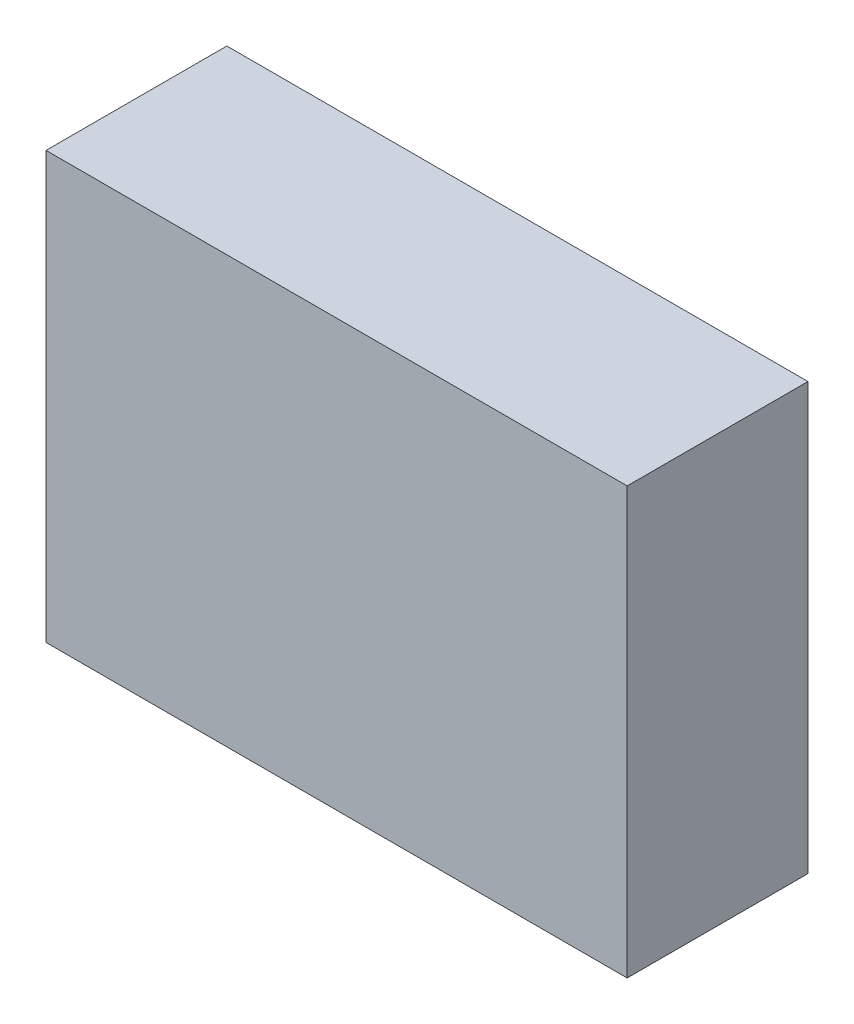
ISO-10303-21;
HEADER;
FILE_DESCRIPTION(('STEP AP214'),'2;1');
FILE_NAME('part.step','',(''),(''),'','','');
FILE_SCHEMA(('AUTOMOTIVE_DESIGN { 1 0 10303 214 1 1 1 1 }'));
ENDSEC;
DATA;
#1=APPLICATION_CONTEXT('core data for automotive mechanical design processes');
#2=APPLICATION_PROTOCOL_DEFINITION('international standard','automotive_design',2000,#1);
#3=PRODUCT_CONTEXT('',#1,'mechanical');
#4=PRODUCT('Part','Part','',(#3));
#5=PRODUCT_RELATED_PRODUCT_CATEGORY('part','',(#4));
#6=PRODUCT_DEFINITION_FORMATION('','',#4);
#7=PRODUCT_DEFINITION_CONTEXT('part definition',#1,'design');
#8=PRODUCT_DEFINITION('design','',#6,#7);
#9=PRODUCT_DEFINITION_SHAPE('','',#8);
#10=(LENGTH_UNIT() NAMED_UNIT(*) SI_UNIT(.MILLI.,.METRE.));
#11=(NAMED_UNIT(*) PLANE_ANGLE_UNIT() SI_UNIT($,.RADIAN.));
#12=(NAMED_UNIT(*) SI_UNIT($,.STERADIAN.) SOLID_ANGLE_UNIT());
#13=UNCERTAINTY_MEASURE_WITH_UNIT(LENGTH_MEASURE(1.E-05),#10,'distance_accuracy_value','');
#14=(GEOMETRIC_REPRESENTATION_CONTEXT(3) GLOBAL_UNCERTAINTY_ASSIGNED_CONTEXT((#13)) GLOBAL_UNIT_ASSIGNED_CONTEXT((#10,
#11,#12)) REPRESENTATION_CONTEXT('',''));
#15=CARTESIAN_POINT('',(0.,0.,0.));
#16=DIRECTION('',(0.,0.,1.));
#17=DIRECTION('',(1.,0.,0.));
#18=AXIS2_PLACEMENT_3D('',#15,#16,#17);
#19=CARTESIAN_POINT('',(-1.1250019975716,-0.825011071186395,-2.84112203121185));
#20=DIRECTION('',(-1.19248806385031E-08,-1.,0.));
#21=DIRECTION('',(1.,-1.19248806385031E-08,0.));
#22=AXIS2_PLACEMENT_3D('',#19,#20,#21);
#23=PLANE('',#22);
#24=DIRECTION('',(1.,-1.19248806617713E-08,0.));
#25=VECTOR('',#24,1.);
#26=CARTESIAN_POINT('',(-1.1250019975716,-0.825011071186395,-2.84112203121185));
#27=LINE('',#26,#25);
#28=CARTESIAN_POINT('',(-1.1250019975716,-0.825011071186395,-2.84112203121185));
#29=VERTEX_POINT('',#28);
#30=CARTESIAN_POINT('',(1.12499037303387,-0.825011098017285,-2.84112203121185));
#31=VERTEX_POINT('',#30);
#32=EDGE_CURVE('E11',#29,#31,#27,.T.);
#33=ORIENTED_EDGE('',*,*,#32,.T.);
#34=DIRECTION('',(0.,0.,1.));
#35=VECTOR('',#34,1.);
#36=CARTESIAN_POINT('',(1.12499037303387,-0.825011098017286,-2.84112203121185));
#37=LINE('',#36,#35);
#38=CARTESIAN_POINT('',(1.12499037303387,-0.825011098017285,-2.14112091064453));
#39=VERTEX_POINT('',#38);
#40=EDGE_CURVE('E88',#31,#39,#37,.T.);
#41=ORIENTED_EDGE('',*,*,#40,.T.);
#42=DIRECTION('',(1.,-1.19248806617713E-08,0.));
#43=VECTOR('',#42,1.);
#44=CARTESIAN_POINT('',(-1.1250019975716,-0.825011071186395,-2.14112091064453));
#45=LINE('',#44,#43);
#46=CARTESIAN_POINT('',(-1.1250019975716,-0.825011071186395,-2.14112091064453));
#47=VERTEX_POINT('',#46);
#48=EDGE_CURVE('E83',#47,#39,#45,.T.);
#49=ORIENTED_EDGE('',*,*,#48,.F.);
#50=DIRECTION('',(0.,0.,1.));
#51=VECTOR('',#50,1.);
#52=CARTESIAN_POINT('',(-1.1250019975716,-0.825011071186395,-2.84112203121185));
#53=LINE('',#52,#51);
#54=EDGE_CURVE('E72',#29,#47,#53,.T.);
#55=ORIENTED_EDGE('',*,*,#54,.F.);
#56=EDGE_LOOP('',(#33,#41,#49,#55));
#57=FACE_BOUND('',#56,.T.);
#58=ADVANCED_FACE('F17',(#57),#23,.T.);
#59=CARTESIAN_POINT('',(1.12499037303387,-0.825011098017285,-2.84112203121185));
#60=DIRECTION('',(1.,-1.19248806385031E-08,0.));
#61=DIRECTION('',(1.19248806385031E-08,1.,0.));
#62=AXIS2_PLACEMENT_3D('',#59,#60,#61);
#63=PLANE('',#62);
#64=DIRECTION('',(1.19248805831428E-08,1.,0.));
#65=VECTOR('',#64,1.);
#66=CARTESIAN_POINT('',(1.12499037303387,-0.825011098017285,-2.84112203121185));
#67=LINE('',#66,#65);
#68=CARTESIAN_POINT('',(1.12499039270985,0.82498279846709,-2.84112203121185));
#69=VERTEX_POINT('',#68);
#70=EDGE_CURVE('E24',#31,#69,#67,.T.);
#71=ORIENTED_EDGE('',*,*,#70,.T.);
#72=DIRECTION('',(0.,0.,1.));
#73=VECTOR('',#72,1.);
#74=CARTESIAN_POINT('',(1.12499039270985,0.82498279846709,-2.84112203121185));
#75=LINE('',#74,#73);
#76=CARTESIAN_POINT('',(1.12499039270985,0.82498279846709,-2.14112091064453));
#77=VERTEX_POINT('',#76);
#78=EDGE_CURVE('E85',#69,#77,#75,.T.);
#79=ORIENTED_EDGE('',*,*,#78,.T.);
#80=DIRECTION('',(1.19248805831428E-08,1.,0.));
#81=VECTOR('',#80,1.);
#82=CARTESIAN_POINT('',(1.12499037303387,-0.825011098017285,-2.14112091064453));
#83=LINE('',#82,#81);
#84=EDGE_CURVE('E66',#39,#77,#83,.T.);
#85=ORIENTED_EDGE('',*,*,#84,.F.);
#86=ORIENTED_EDGE('',*,*,#40,.F.);
#87=EDGE_LOOP('',(#71,#79,#85,#86));
#88=FACE_BOUND('',#87,.T.);
#89=ADVANCED_FACE('F89',(#88),#63,.T.);
#90=CARTESIAN_POINT('',(1.12499039270985,0.82498279846709,-2.84112203121185));
#91=DIRECTION('',(1.19248806385031E-08,1.,0.));
#92=DIRECTION('',(-1.,1.19248806385031E-08,0.));
#93=AXIS2_PLACEMENT_3D('',#90,#91,#92);
#94=PLANE('',#93);
#95=DIRECTION('',(-1.,1.19248806617713E-08,0.));
#96=VECTOR('',#95,1.);
#97=CARTESIAN_POINT('',(1.12499039270985,0.82498279846709,-2.84112203121185));
#98=LINE('',#97,#96);
#99=CARTESIAN_POINT('',(-1.12500197789562,0.82498282529798,-2.84112203121185));
#100=VERTEX_POINT('',#99);
#101=EDGE_CURVE('E62',#69,#100,#98,.T.);
#102=ORIENTED_EDGE('',*,*,#101,.T.);
#103=DIRECTION('',(0.,0.,1.));
#104=VECTOR('',#103,1.);
#105=CARTESIAN_POINT('',(-1.12500197789562,0.824982825297981,-2.84112203121185));
#106=LINE('',#105,#104);
#107=CARTESIAN_POINT('',(-1.12500197789562,0.82498282529798,-2.14112091064453));
#108=VERTEX_POINT('',#107);
#109=EDGE_CURVE('E55',#100,#108,#106,.T.);
#110=ORIENTED_EDGE('',*,*,#109,.T.);
#111=DIRECTION('',(-1.,1.19248806617713E-08,0.));
#112=VECTOR('',#111,1.);
#113=CARTESIAN_POINT('',(1.12499039270985,0.82498279846709,-2.14112091064453));
#114=LINE('',#113,#112);
#115=EDGE_CURVE('E59',#77,#108,#114,.T.);
#116=ORIENTED_EDGE('',*,*,#115,.F.);
#117=ORIENTED_EDGE('',*,*,#78,.F.);
#118=EDGE_LOOP('',(#102,#110,#116,#117));
#119=FACE_BOUND('',#118,.T.);
#120=ADVANCED_FACE('F57',(#119),#94,.T.);
#121=CARTESIAN_POINT('',(-1.12500197789562,0.82498282529798,-2.84112203121185));
#122=DIRECTION('',(-1.,1.19248806385031E-08,0.));
#123=DIRECTION('',(-1.19248806385031E-08,-1.,0.));
#124=AXIS2_PLACEMENT_3D('',#121,#122,#123);
#125=PLANE('',#124);
#126=DIRECTION('',(-1.19248805831428E-08,-1.,0.));
#127=VECTOR('',#126,1.);
#128=CARTESIAN_POINT('',(-1.12500197789562,0.82498282529798,-2.84112203121185));
#129=LINE('',#128,#127);
#130=EDGE_CURVE('E65',#100,#29,#129,.T.);
#131=ORIENTED_EDGE('',*,*,#130,.T.);
#132=ORIENTED_EDGE('',*,*,#54,.T.);
#133=DIRECTION('',(-1.19248805831428E-08,-1.,0.));
#134=VECTOR('',#133,1.);
#135=CARTESIAN_POINT('',(-1.12500197789562,0.82498282529798,-2.14112091064453));
#136=LINE('',#135,#134);
#137=EDGE_CURVE('E70',#108,#47,#136,.T.);
#138=ORIENTED_EDGE('',*,*,#137,.F.);
#139=ORIENTED_EDGE('',*,*,#109,.F.);
#140=EDGE_LOOP('',(#131,#132,#138,#139));
#141=FACE_BOUND('',#140,.T.);
#142=ADVANCED_FACE('F71',(#141),#125,.T.);
#143=CARTESIAN_POINT('',(94.1249923706055,-473.100006103516,-2.14112091064453));
#144=DIRECTION('',(0.,0.,1.));
#145=DIRECTION('',(1.19248806385031E-08,1.,0.));
#146=AXIS2_PLACEMENT_3D('',#143,#144,#145);
#147=PLANE('',#146);
#148=ORIENTED_EDGE('',*,*,#48,.T.);
#149=ORIENTED_EDGE('',*,*,#84,.T.);
#150=ORIENTED_EDGE('',*,*,#115,.T.);
#151=ORIENTED_EDGE('',*,*,#137,.T.);
#152=EDGE_LOOP('',(#148,#149,#150,#151));
#153=FACE_BOUND('',#152,.T.);
#154=ADVANCED_FACE('F76',(#153),#147,.T.);
#155=CARTESIAN_POINT('',(94.1249923706055,-473.100006103516,-2.84112203121185));
#156=DIRECTION('',(0.,0.,1.));
#157=DIRECTION('',(1.19248806385031E-08,1.,0.));
#158=AXIS2_PLACEMENT_3D('',#155,#156,#157);
#159=PLANE('',#158);
#160=ORIENTED_EDGE('',*,*,#130,.F.);
#161=ORIENTED_EDGE('',*,*,#101,.F.);
#162=ORIENTED_EDGE('',*,*,#70,.F.);
#163=ORIENTED_EDGE('',*,*,#32,.F.);
#164=EDGE_LOOP('',(#160,#161,#162,#163));
#165=FACE_BOUND('',#164,.T.);
#166=ADVANCED_FACE('F91',(#165),#159,.F.);
#167=CLOSED_SHELL('',(#58,#89,#120,#142,#154,#166));
#168=MANIFOLD_SOLID_BREP('B1',#167);
#169=ADVANCED_BREP_SHAPE_REPRESENTATION('',(#18,#168),#14);
#170=SHAPE_DEFINITION_REPRESENTATION(#9,#169);
ENDSEC;
END-ISO-10303-21;
